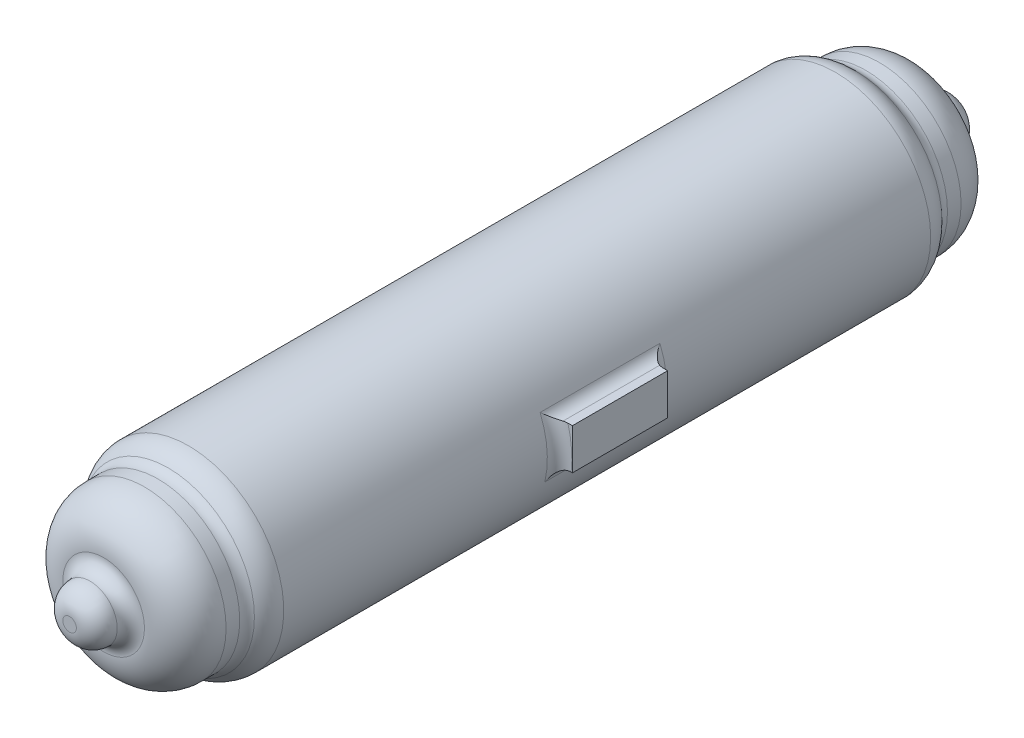
ISO-10303-21;
HEADER;
FILE_DESCRIPTION(('STEP AP214'),'2;1');
FILE_NAME('part.step','',(''),(''),'','','');
FILE_SCHEMA(('AUTOMOTIVE_DESIGN { 1 0 10303 214 1 1 1 1 }'));
ENDSEC;
DATA;
#1=APPLICATION_CONTEXT('core data for automotive mechanical design processes');
#2=APPLICATION_PROTOCOL_DEFINITION('international standard','automotive_design',2000,#1);
#3=PRODUCT_CONTEXT('',#1,'mechanical');
#4=PRODUCT('Part','Part','',(#3));
#5=PRODUCT_RELATED_PRODUCT_CATEGORY('part','',(#4));
#6=PRODUCT_DEFINITION_FORMATION('','',#4);
#7=PRODUCT_DEFINITION_CONTEXT('part definition',#1,'design');
#8=PRODUCT_DEFINITION('design','',#6,#7);
#9=PRODUCT_DEFINITION_SHAPE('','',#8);
#10=(LENGTH_UNIT() NAMED_UNIT(*) SI_UNIT(.MILLI.,.METRE.));
#11=(NAMED_UNIT(*) PLANE_ANGLE_UNIT() SI_UNIT($,.RADIAN.));
#12=(NAMED_UNIT(*) SI_UNIT($,.STERADIAN.) SOLID_ANGLE_UNIT());
#13=UNCERTAINTY_MEASURE_WITH_UNIT(LENGTH_MEASURE(1.E-05),#10,'distance_accuracy_value','');
#14=(GEOMETRIC_REPRESENTATION_CONTEXT(3) GLOBAL_UNCERTAINTY_ASSIGNED_CONTEXT((#13)) GLOBAL_UNIT_ASSIGNED_CONTEXT((#10,
#11,#12)) REPRESENTATION_CONTEXT('',''));
#15=CARTESIAN_POINT('',(0.,0.,0.));
#16=DIRECTION('',(0.,0.,1.));
#17=DIRECTION('',(1.,0.,0.));
#18=AXIS2_PLACEMENT_3D('',#15,#16,#17);
#19=CARTESIAN_POINT('',(0.,0.,-237.639320225002));
#20=DIRECTION('',(0.,0.,1.));
#21=DIRECTION('',(1.,0.,0.));
#22=AXIS2_PLACEMENT_3D('',#19,#20,#21);
#23=TOROIDAL_SURFACE('',#22,50.,20.);
#24=CARTESIAN_POINT('',(0.,0.,-252.546440075001));
#25=DIRECTION('',(0.,0.,-1.));
#26=DIRECTION('',(-1.,0.,0.));
#27=AXIS2_PLACEMENT_3D('',#24,#25,#26);
#28=CIRCLE('',#27,63.3333333333334);
#29=CARTESIAN_POINT('',(-63.3333333333334,0.,-252.546440075001));
#30=VERTEX_POINT('',#29);
#31=EDGE_CURVE('E49',#30,#30,#28,.T.);
#32=ORIENTED_EDGE('',*,*,#31,.F.);
#33=EDGE_LOOP('',(#32));
#34=FACE_BOUND('',#33,.T.);
#35=CARTESIAN_POINT('',(0.,0.,-237.639320225002));
#36=DIRECTION('',(0.,0.,1.));
#37=DIRECTION('',(1.,0.,0.));
#38=AXIS2_PLACEMENT_3D('',#35,#36,#37);
#39=CIRCLE('',#38,70.);
#40=CARTESIAN_POINT('',(70.,0.,-237.639320225002));
#41=VERTEX_POINT('',#40);
#42=EDGE_CURVE('E12',#41,#41,#39,.T.);
#43=ORIENTED_EDGE('',*,*,#42,.F.);
#44=EDGE_LOOP('',(#43));
#45=FACE_BOUND('',#44,.T.);
#46=ADVANCED_FACE('F41',(#34,#45),#23,.T.);
#47=CARTESIAN_POINT('',(0.,0.,-260.));
#48=DIRECTION('',(0.,0.,1.));
#49=DIRECTION('',(1.,0.,0.));
#50=AXIS2_PLACEMENT_3D('',#47,#48,#49);
#51=TOROIDAL_SURFACE('',#50,70.,10.);
#52=ORIENTED_EDGE('',*,*,#31,.T.);
#53=EDGE_LOOP('',(#52));
#54=FACE_BOUND('',#53,.T.);
#55=CARTESIAN_POINT('',(0.,0.,-260.));
#56=DIRECTION('',(0.,0.,1.));
#57=DIRECTION('',(1.,0.,0.));
#58=AXIS2_PLACEMENT_3D('',#55,#56,#57);
#59=CIRCLE('',#58,60.);
#60=CARTESIAN_POINT('',(60.,0.,-260.));
#61=VERTEX_POINT('',#60);
#62=EDGE_CURVE('E303',#61,#61,#59,.F.);
#63=ORIENTED_EDGE('',*,*,#62,.F.);
#64=EDGE_LOOP('',(#63));
#65=FACE_BOUND('',#64,.T.);
#66=ADVANCED_FACE('F290',(#54,#65),#51,.F.);
#67=CARTESIAN_POINT('',(0.,0.,237.639320225002));
#68=DIRECTION('',(0.,0.,-1.));
#69=DIRECTION('',(-1.,0.,0.));
#70=AXIS2_PLACEMENT_3D('',#67,#68,#69);
#71=TOROIDAL_SURFACE('',#70,50.,20.);
#72=CARTESIAN_POINT('',(0.,0.,252.546440075001));
#73=DIRECTION('',(0.,0.,1.));
#74=DIRECTION('',(1.,0.,0.));
#75=AXIS2_PLACEMENT_3D('',#72,#73,#74);
#76=CIRCLE('',#75,63.3333333333333);
#77=CARTESIAN_POINT('',(63.3333333333333,0.,252.546440075001));
#78=VERTEX_POINT('',#77);
#79=EDGE_CURVE('E311',#78,#78,#76,.T.);
#80=ORIENTED_EDGE('',*,*,#79,.F.);
#81=EDGE_LOOP('',(#80));
#82=FACE_BOUND('',#81,.T.);
#83=CARTESIAN_POINT('',(0.,0.,237.639320225002));
#84=DIRECTION('',(0.,0.,-1.));
#85=DIRECTION('',(-1.,0.,0.));
#86=AXIS2_PLACEMENT_3D('',#83,#84,#85);
#87=CIRCLE('',#86,70.);
#88=CARTESIAN_POINT('',(-70.,0.,237.639320225002));
#89=VERTEX_POINT('',#88);
#90=EDGE_CURVE('E306',#89,#89,#87,.T.);
#91=ORIENTED_EDGE('',*,*,#90,.F.);
#92=EDGE_LOOP('',(#91));
#93=FACE_BOUND('',#92,.T.);
#94=ADVANCED_FACE('F287',(#82,#93),#71,.T.);
#95=CARTESIAN_POINT('',(0.,0.,260.));
#96=DIRECTION('',(0.,0.,1.));
#97=DIRECTION('',(1.,0.,0.));
#98=AXIS2_PLACEMENT_3D('',#95,#96,#97);
#99=TOROIDAL_SURFACE('',#98,70.,10.);
#100=ORIENTED_EDGE('',*,*,#79,.T.);
#101=EDGE_LOOP('',(#100));
#102=FACE_BOUND('',#101,.T.);
#103=CARTESIAN_POINT('',(0.,0.,260.));
#104=DIRECTION('',(0.,0.,1.));
#105=DIRECTION('',(1.,0.,0.));
#106=AXIS2_PLACEMENT_3D('',#103,#104,#105);
#107=CIRCLE('',#106,60.);
#108=CARTESIAN_POINT('',(60.,0.,260.));
#109=VERTEX_POINT('',#108);
#110=EDGE_CURVE('E316',#109,#109,#107,.T.);
#111=ORIENTED_EDGE('',*,*,#110,.F.);
#112=EDGE_LOOP('',(#111));
#113=FACE_BOUND('',#112,.T.);
#114=ADVANCED_FACE('F283',(#102,#113),#99,.F.);
#115=CARTESIAN_POINT('',(76.9446358125888,-17.9031566956245,250.));
#116=DIRECTION('',(0.,0.,-1.));
#117=DIRECTION('',(-1.,0.,0.));
#118=AXIS2_PLACEMENT_3D('',#115,#116,#117);
#119=CYLINDRICAL_SURFACE('',#118,9.);
#120=CARTESIAN_POINT('',(76.9446358125888,-8.90315669562447,-35.1330803444123));
#121=CARTESIAN_POINT('',(76.8339645059694,-8.90315493318954,-35.1521969879144));
#122=CARTESIAN_POINT('',(76.7236628981182,-8.90519853367659,-35.173319306642));
#123=CARTESIAN_POINT('',(76.5040417115562,-8.91327649145585,-35.2194566820043));
#124=CARTESIAN_POINT('',(76.3947219781456,-8.91931020849282,-35.2444711136172));
#125=CARTESIAN_POINT('',(76.0689197763461,-8.94322022670623,-35.3250924864422));
#126=CARTESIAN_POINT('',(75.8542126586325,-8.96690609617652,-35.3863439769867));
#127=CARTESIAN_POINT('',(75.4336486588862,-9.02838069555526,-35.5219440902154));
#128=CARTESIAN_POINT('',(75.2277228471797,-9.0660198273779,-35.5961495169001));
#129=CARTESIAN_POINT('',(74.8235070156009,-9.15423557916891,-35.7568080644692));
#130=CARTESIAN_POINT('',(74.6252196860896,-9.20481671037972,-35.8432654513686));
#131=CARTESIAN_POINT('',(74.2383919874291,-9.31732058180232,-36.0265278970516));
#132=CARTESIAN_POINT('',(74.0498006174826,-9.37917400629715,-36.1232682859496));
#133=CARTESIAN_POINT('',(73.6816918791693,-9.51318785961963,-36.3262162546603));
#134=CARTESIAN_POINT('',(73.5021735601506,-9.5853472055746,-36.4324228393926));
#135=CARTESIAN_POINT('',(72.976628016284,-9.81603591903803,-36.7641397146616));
#136=CARTESIAN_POINT('',(72.644523158482,-9.98850076933427,-37.0023051751521));
#137=CARTESIAN_POINT('',(72.0800830274243,-10.3254275164063,-37.4542742445337));
#138=CARTESIAN_POINT('',(71.8409773735565,-10.4847813607783,-37.663644087628));
#139=CARTESIAN_POINT('',(71.3863405542848,-10.8190238571233,-38.0954445196285));
#140=CARTESIAN_POINT('',(71.1708210890001,-10.9939201418015,-38.3178815072746));
#141=CARTESIAN_POINT('',(70.762265490633,-11.3569244871966,-38.7734393434941));
#142=CARTESIAN_POINT('',(70.5692783330239,-11.5450599531372,-39.0065819845213));
#143=CARTESIAN_POINT('',(70.2054015140808,-11.9321219805371,-39.4808775498524));
#144=CARTESIAN_POINT('',(70.03451010299,-12.1310476857468,-39.7220298379711));
#145=CARTESIAN_POINT('',(69.6629904027146,-12.6027578199943,-40.2882007136749));
#146=CARTESIAN_POINT('',(69.4701613915597,-12.8789302377661,-40.6155250444978));
#147=CARTESIAN_POINT('',(69.1196612857071,-13.4444056727558,-41.2777136918351));
#148=CARTESIAN_POINT('',(68.9620057791744,-13.7337144436454,-41.6125812792707));
#149=CARTESIAN_POINT('',(68.6811368507772,-14.3225477728143,-42.2862180462611));
#150=CARTESIAN_POINT('',(68.5578479434008,-14.6220482940046,-42.6249769456749));
#151=CARTESIAN_POINT('',(68.3447335235228,-15.2300768604686,-43.3045913923678));
#152=CARTESIAN_POINT('',(68.254886264927,-15.5385988980286,-43.6454454301209));
#153=CARTESIAN_POINT('',(68.1807590755132,-15.8551129291248,-43.9907895818551));
#154=CARTESIAN_POINT('',(68.1797736248304,-15.8593344040268,-43.9953948030136));
#155=CARTESIAN_POINT('',(68.1787912263445,-15.8635565657432,-44.));
#156=B_SPLINE_CURVE_WITH_KNOTS('',3,(#120,#121,#122,#123,#124,#125,#126,#127,#128,#129,#130,
#131,#132,#133,#134,#135,#136,#137,#138,#139,#140,#141,#142,#143,#144,#145,#146,#147,#148,#149,
#150,#151,#152,#153,#154,#155),.UNSPECIFIED.,.F.,.F.,(4,2,2,2,2,2,2,2,2,2,2,2,2,2,2,2,2,4),(0.,
0.336851049774516,0.673648061442833,1.34608514120215,2.01151199204817,2.67717111003305,
3.3388671906817,4.00049379610853,5.32687064617143,6.39214059788593,7.45793661272515,
8.52600770006759,9.59399415525058,11.0012535181678,12.4091353157129,13.8138999156169,
15.2177494369689,15.2367231052564),.UNSPECIFIED.);
#157=CARTESIAN_POINT('',(76.9446358125888,-8.90315669562447,-35.1330803444123));
#158=VERTEX_POINT('',#157);
#159=CARTESIAN_POINT('',(68.1787912263445,-15.8635565657432,-44.));
#160=VERTEX_POINT('',#159);
#161=EDGE_CURVE('E274',#158,#160,#156,.T.);
#162=ORIENTED_EDGE('',*,*,#161,.F.);
#163=DIRECTION('',(0.,0.,1.));
#164=VECTOR('',#163,1.);
#165=CARTESIAN_POINT('',(76.9446358125888,-8.90315669562447,250.));
#166=LINE('',#165,#164);
#167=CARTESIAN_POINT('',(76.9446358125888,-8.90315669562447,35.1330803444123));
#168=VERTEX_POINT('',#167);
#169=EDGE_CURVE('E56',#168,#158,#166,.F.);
#170=ORIENTED_EDGE('',*,*,#169,.F.);
#171=CARTESIAN_POINT('',(76.9446358125888,-8.90315669562447,35.1330803444123));
#172=CARTESIAN_POINT('',(76.8339645059694,-8.90315493318954,35.1521969879145));
#173=CARTESIAN_POINT('',(76.7236628981182,-8.90519853367659,35.173319306642));
#174=CARTESIAN_POINT('',(76.5040417115562,-8.91327649145585,35.2194566820044));
#175=CARTESIAN_POINT('',(76.3947219781456,-8.91931020849282,35.2444711136172));
#176=CARTESIAN_POINT('',(76.0689197763461,-8.94322022670623,35.3250924864422));
#177=CARTESIAN_POINT('',(75.8542126586325,-8.96690609617652,35.3863439769867));
#178=CARTESIAN_POINT('',(75.4336486588862,-9.02838069555526,35.5219440902155));
#179=CARTESIAN_POINT('',(75.2277228471797,-9.0660198273779,35.5961495169002));
#180=CARTESIAN_POINT('',(74.8235070156009,-9.15423557916891,35.7568080644693));
#181=CARTESIAN_POINT('',(74.6252196860896,-9.20481671037972,35.8432654513686));
#182=CARTESIAN_POINT('',(74.2383919874291,-9.31732058180232,36.0265278970516));
#183=CARTESIAN_POINT('',(74.0498006174826,-9.37917400629715,36.1232682859496));
#184=CARTESIAN_POINT('',(73.6816918791693,-9.51318785961963,36.3262162546603));
#185=CARTESIAN_POINT('',(73.5021735601506,-9.5853472055746,36.4324228393926));
#186=CARTESIAN_POINT('',(72.976628016284,-9.81603591903803,36.7641397146616));
#187=CARTESIAN_POINT('',(72.644523158482,-9.98850076933427,37.0023051751522));
#188=CARTESIAN_POINT('',(72.0800830274243,-10.3254275164063,37.4542742445337));
#189=CARTESIAN_POINT('',(71.8409773735565,-10.4847813607783,37.663644087628));
#190=CARTESIAN_POINT('',(71.3863405542848,-10.8190238571233,38.0954445196285));
#191=CARTESIAN_POINT('',(71.1708210890001,-10.9939201418015,38.3178815072746));
#192=CARTESIAN_POINT('',(70.762265490633,-11.3569244871966,38.7734393434941));
#193=CARTESIAN_POINT('',(70.5692783330239,-11.5450599531372,39.0065819845213));
#194=CARTESIAN_POINT('',(70.2054015140808,-11.9321219805371,39.4808775498524));
#195=CARTESIAN_POINT('',(70.03451010299,-12.1310476857468,39.7220298379711));
#196=CARTESIAN_POINT('',(69.6629904027146,-12.6027578199943,40.288200713675));
#197=CARTESIAN_POINT('',(69.4701613915597,-12.8789302377661,40.6155250444978));
#198=CARTESIAN_POINT('',(69.1196612857071,-13.4444056727558,41.2777136918351));
#199=CARTESIAN_POINT('',(68.9620057791744,-13.7337144436454,41.6125812792707));
#200=CARTESIAN_POINT('',(68.6811368507772,-14.3225477728143,42.2862180462611));
#201=CARTESIAN_POINT('',(68.5578479434008,-14.6220482940046,42.6249769456749));
#202=CARTESIAN_POINT('',(68.3447335235228,-15.2300768604686,43.3045913923679));
#203=CARTESIAN_POINT('',(68.254886264927,-15.5385988980286,43.6454454301209));
#204=CARTESIAN_POINT('',(68.1807590755132,-15.8551129291248,43.9907895818551));
#205=CARTESIAN_POINT('',(68.1797736248304,-15.8593344040268,43.9953948030136));
#206=CARTESIAN_POINT('',(68.1787912263445,-15.8635565657432,44.));
#207=B_SPLINE_CURVE_WITH_KNOTS('',3,(#171,#172,#173,#174,#175,#176,#177,#178,#179,#180,#181,
#182,#183,#184,#185,#186,#187,#188,#189,#190,#191,#192,#193,#194,#195,#196,#197,#198,#199,#200,
#201,#202,#203,#204,#205,#206),.UNSPECIFIED.,.F.,.F.,(4,2,2,2,2,2,2,2,2,2,2,2,2,2,2,2,2,4),(0.,
0.336851049774516,0.673648061442833,1.34608514120215,2.01151199204817,2.67717111003305,
3.3388671906817,4.00049379610853,5.32687064617143,6.39214059788593,7.45793661272515,
8.52600770006759,9.59399415525058,11.0012535181678,12.4091353157129,13.8138999156169,
15.2177494369689,15.2367231052564),.UNSPECIFIED.);
#208=CARTESIAN_POINT('',(68.1787912263445,-15.8635565657432,44.));
#209=VERTEX_POINT('',#208);
#210=EDGE_CURVE('E267',#168,#209,#207,.T.);
#211=ORIENTED_EDGE('',*,*,#210,.T.);
#212=DIRECTION('',(0.,0.,-1.));
#213=VECTOR('',#212,1.);
#214=CARTESIAN_POINT('',(68.1787912263445,-15.8635565657432,250.));
#215=LINE('',#214,#213);
#216=EDGE_CURVE('E176',#160,#209,#215,.F.);
#217=ORIENTED_EDGE('',*,*,#216,.F.);
#218=EDGE_LOOP('',(#162,#170,#211,#217));
#219=FACE_BOUND('',#218,.T.);
#220=ADVANCED_FACE('F253',(#219),#119,.F.);
#221=CARTESIAN_POINT('',(0.,0.,44.));
#222=DIRECTION('',(0.,0.,-1.));
#223=DIRECTION('',(-1.,0.,0.));
#224=AXIS2_PLACEMENT_3D('',#221,#222,#223);
#225=TOROIDAL_SURFACE('',#224,79.,9.);
#226=ORIENTED_EDGE('',*,*,#210,.F.);
#227=CARTESIAN_POINT('',(76.9446358125888,-8.90315669562447,35.1330803444123));
#228=CARTESIAN_POINT('',(77.2014169186937,-8.90315669562447,35.0887621161174));
#229=CARTESIAN_POINT('',(77.4591471263024,-8.90315669562447,35.0555129732738));
#230=CARTESIAN_POINT('',(77.9765058673671,-8.90315669562447,35.0111528479569));
#231=CARTESIAN_POINT('',(78.2361344017245,-8.90315669562447,35.0000418759964));
#232=CARTESIAN_POINT('',(78.4967120384871,-8.90315669562447,35.));
#233=B_SPLINE_CURVE_WITH_KNOTS('',3,(#227,#228,#229,#230,#231,#232),.UNSPECIFIED.,.F.,.F.,(4,2,
4),(0.,0.779598158492503,1.55919668719435),.UNSPECIFIED.);
#234=CARTESIAN_POINT('',(78.4967120384871,-8.90315669562447,35.));
#235=VERTEX_POINT('',#234);
#236=EDGE_CURVE('E230',#235,#168,#233,.F.);
#237=ORIENTED_EDGE('',*,*,#236,.F.);
#238=CARTESIAN_POINT('',(0.,0.,35.));
#239=DIRECTION('',(0.,0.,-1.));
#240=DIRECTION('',(-1.,0.,0.));
#241=AXIS2_PLACEMENT_3D('',#238,#239,#240);
#242=CIRCLE('',#241,79.);
#243=CARTESIAN_POINT('',(76.1309608673806,21.0968433043755,35.));
#244=VERTEX_POINT('',#243);
#245=EDGE_CURVE('E194',#244,#235,#242,.T.);
#246=ORIENTED_EDGE('',*,*,#245,.F.);
#247=CARTESIAN_POINT('',(76.1309608673806,21.0968433043755,35.));
#248=CARTESIAN_POINT('',(75.8681508332055,21.0968433043755,34.9999822774768));
#249=CARTESIAN_POINT('',(75.6053460157413,21.0968433043755,35.0106905520901));
#250=CARTESIAN_POINT('',(75.0831770517015,21.0968433043755,35.0532375005064));
#251=CARTESIAN_POINT('',(74.8238016439224,21.0968433043755,35.0849379978813));
#252=CARTESIAN_POINT('',(74.3084557039351,21.0968433043755,35.1691524802424));
#253=CARTESIAN_POINT('',(74.0524851133079,21.0968433043755,35.221666107646));
#254=CARTESIAN_POINT('',(73.5439526244104,21.0968433043755,35.3475852830205));
#255=CARTESIAN_POINT('',(73.2914241047833,21.0968433043755,35.4211256289625));
#256=CARTESIAN_POINT('',(73.042316660357,21.0968433043755,35.5048709587407));
#257=B_SPLINE_CURVE_WITH_KNOTS('',3,(#247,#248,#249,#250,#251,#252,#253,#254,#255,#256),
.UNSPECIFIED.,.F.,.F.,(4,2,2,2,4),(0.,0.788204161147778,1.5712710464994,2.35432447885427,
3.14251500617013),.UNSPECIFIED.);
#258=CARTESIAN_POINT('',(73.042316660357,21.0968433043755,35.5048709587407));
#259=VERTEX_POINT('',#258);
#260=EDGE_CURVE('E113',#259,#244,#257,.F.);
#261=ORIENTED_EDGE('',*,*,#260,.F.);
#262=CARTESIAN_POINT('',(73.042316660357,21.0968433043755,35.5048709587407));
#263=CARTESIAN_POINT('',(72.7953696557035,21.0968167949234,35.5878337247568));
#264=CARTESIAN_POINT('',(72.5517264266638,21.1070028410716,35.6798939460691));
#265=CARTESIAN_POINT('',(72.0731347793559,21.1459740200223,35.8798630214084));
#266=CARTESIAN_POINT('',(71.8381691317983,21.1747199412943,35.9877380928008));
#267=CARTESIAN_POINT('',(71.3807427778729,21.2485517306069,36.21597283515));
#268=CARTESIAN_POINT('',(71.1581654011846,21.2934362708248,36.3361661749019));
#269=CARTESIAN_POINT('',(70.7231909903968,21.3978944087016,36.5882610903496));
#270=CARTESIAN_POINT('',(70.5108007202251,21.4574776088725,36.7201702837182));
#271=CARTESIAN_POINT('',(70.0382736028182,21.6084138634419,37.032636883215));
#272=CARTESIAN_POINT('',(69.7816077327723,21.7039865447555,37.2164068942199));
#273=CARTESIAN_POINT('',(69.2863703701836,21.913616402145,37.5971747379357));
#274=CARTESIAN_POINT('',(69.0478014894382,22.0276762389053,37.7941744722839));
#275=CARTESIAN_POINT('',(68.5872100332019,22.2724930132453,38.2000814619278));
#276=CARTESIAN_POINT('',(68.3652978290427,22.403348000596,38.4090542968654));
#277=CARTESIAN_POINT('',(67.9392866079286,22.6790632208266,38.8356469082324));
#278=CARTESIAN_POINT('',(67.7351884224006,22.8239241067341,39.053267087567));
#279=CARTESIAN_POINT('',(67.2626469555809,23.1890153818194,39.5877950952529));
#280=CARTESIAN_POINT('',(67.0029359783354,23.4154534426394,39.9082068012195));
#281=CARTESIAN_POINT('',(66.5169744452642,23.889178175672,40.5589626329876));
#282=CARTESIAN_POINT('',(66.2907411021914,24.1364754709217,40.8893117638777));
#283=CARTESIAN_POINT('',(65.8713038082273,24.6483754129503,41.5558537302301));
#284=CARTESIAN_POINT('',(65.6780235239321,24.9129360474215,41.892031017031));
#285=CARTESIAN_POINT('',(65.3232986762071,25.4576285680185,42.5681913052122));
#286=CARTESIAN_POINT('',(65.1618353287435,25.7377511407191,42.9081719351232));
#287=CARTESIAN_POINT('',(64.9637061878084,26.1282801416689,43.3716532289937));
#288=CARTESIAN_POINT('',(64.9132763950607,26.2326334837424,43.494522348968));
#289=CARTESIAN_POINT('',(64.8165449671819,26.4430663064843,43.7403242675083));
#290=CARTESIAN_POINT('',(64.7702415419494,26.5491450148033,43.8632570149613));
#291=CARTESIAN_POINT('',(64.7243459806889,26.6600741015024,43.9907895685099));
#292=CARTESIAN_POINT('',(64.7226915801851,26.6640809609933,43.995394789743));
#293=CARTESIAN_POINT('',(64.7210400787974,26.6680890038771,44.));
#294=B_SPLINE_CURVE_WITH_KNOTS('',3,(#262,#263,#264,#265,#266,#267,#268,#269,#270,#271,#272,
#273,#274,#275,#276,#277,#278,#279,#280,#281,#282,#283,#284,#285,#286,#287,#288,#289,#290,#291,
#292,#293),.UNSPECIFIED.,.F.,.F.,(4,2,2,2,2,2,2,2,2,2,2,2,2,2,2,4),(0.,0.780813084778847,
1.55998191640193,2.32974998517012,3.10002227496107,4.08799574436563,5.07611153006743,
6.07028333900643,7.06450152376198,8.47400060434402,9.88422188905141,11.2911307548812,
12.6972065069883,13.2038913245743,13.7103552510196,13.7293289193071),.UNSPECIFIED.);
#295=CARTESIAN_POINT('',(64.7210400787974,26.668089003877,44.));
#296=VERTEX_POINT('',#295);
#297=EDGE_CURVE('E261',#259,#296,#294,.T.);
#298=ORIENTED_EDGE('',*,*,#297,.T.);
#299=CARTESIAN_POINT('',(0.,0.,44.));
#300=DIRECTION('',(0.,0.,-1.));
#301=DIRECTION('',(-1.,0.,0.));
#302=AXIS2_PLACEMENT_3D('',#299,#300,#301);
#303=CIRCLE('',#302,70.);
#304=EDGE_CURVE('E180',#209,#296,#303,.F.);
#305=ORIENTED_EDGE('',*,*,#304,.F.);
#306=EDGE_LOOP('',(#226,#237,#246,#261,#298,#305));
#307=FACE_BOUND('',#306,.T.);
#308=ADVANCED_FACE('F249',(#307),#225,.F.);
#309=CARTESIAN_POINT('',(73.042316660357,30.0968433043755,250.));
#310=DIRECTION('',(0.,0.,-1.));
#311=DIRECTION('',(-1.,0.,0.));
#312=AXIS2_PLACEMENT_3D('',#309,#310,#311);
#313=CYLINDRICAL_SURFACE('',#312,9.);
#314=ORIENTED_EDGE('',*,*,#297,.F.);
#315=DIRECTION('',(0.,0.,1.));
#316=VECTOR('',#315,1.);
#317=CARTESIAN_POINT('',(73.042316660357,21.0968433043755,250.));
#318=LINE('',#317,#316);
#319=CARTESIAN_POINT('',(73.042316660357,21.0968433043755,-35.5048709587407));
#320=VERTEX_POINT('',#319);
#321=EDGE_CURVE('E64',#320,#259,#318,.T.);
#322=ORIENTED_EDGE('',*,*,#321,.F.);
#323=CARTESIAN_POINT('',(73.042316660357,21.0968433043755,-35.5048709587407));
#324=CARTESIAN_POINT('',(72.7953696557035,21.0968167949234,-35.5878337247568));
#325=CARTESIAN_POINT('',(72.5517264266638,21.1070028410716,-35.6798939460691));
#326=CARTESIAN_POINT('',(72.0731347793559,21.1459740200223,-35.8798630214084));
#327=CARTESIAN_POINT('',(71.8381691317983,21.1747199412943,-35.9877380928007));
#328=CARTESIAN_POINT('',(71.3807427778729,21.2485517306069,-36.21597283515));
#329=CARTESIAN_POINT('',(71.1581654011846,21.2934362708248,-36.3361661749019));
#330=CARTESIAN_POINT('',(70.7231909903968,21.3978944087016,-36.5882610903495));
#331=CARTESIAN_POINT('',(70.5108007202251,21.4574776088725,-36.7201702837181));
#332=CARTESIAN_POINT('',(70.0382736028182,21.6084138634419,-37.032636883215));
#333=CARTESIAN_POINT('',(69.7816077327723,21.7039865447555,-37.2164068942199));
#334=CARTESIAN_POINT('',(69.2863703701836,21.913616402145,-37.5971747379357));
#335=CARTESIAN_POINT('',(69.0478014894382,22.0276762389053,-37.7941744722839));
#336=CARTESIAN_POINT('',(68.5872100332019,22.2724930132453,-38.2000814619278));
#337=CARTESIAN_POINT('',(68.3652978290427,22.403348000596,-38.4090542968653));
#338=CARTESIAN_POINT('',(67.9392866079286,22.6790632208266,-38.8356469082324));
#339=CARTESIAN_POINT('',(67.7351884224006,22.8239241067341,-39.053267087567));
#340=CARTESIAN_POINT('',(67.2626469555809,23.1890153818194,-39.5877950952529));
#341=CARTESIAN_POINT('',(67.0029359783354,23.4154534426394,-39.9082068012195));
#342=CARTESIAN_POINT('',(66.5169744452643,23.889178175672,-40.5589626329876));
#343=CARTESIAN_POINT('',(66.2907411021914,24.1364754709217,-40.8893117638777));
#344=CARTESIAN_POINT('',(65.8713038082273,24.6483754129503,-41.5558537302301));
#345=CARTESIAN_POINT('',(65.6780235239321,24.9129360474215,-41.8920310170309));
#346=CARTESIAN_POINT('',(65.3232986762071,25.4576285680185,-42.5681913052122));
#347=CARTESIAN_POINT('',(65.1618353287435,25.737751140719,-42.9081719351232));
#348=CARTESIAN_POINT('',(64.9637061878084,26.1282801416689,-43.3716532289937));
#349=CARTESIAN_POINT('',(64.9132763950607,26.2326334837425,-43.494522348968));
#350=CARTESIAN_POINT('',(64.8165449671819,26.4430663064844,-43.7403242675082));
#351=CARTESIAN_POINT('',(64.7702415419494,26.5491450148032,-43.8632570149613));
#352=CARTESIAN_POINT('',(64.7243459806889,26.6600741015024,-43.9907895685098));
#353=CARTESIAN_POINT('',(64.7226915801851,26.6640809609933,-43.9953947897429));
#354=CARTESIAN_POINT('',(64.7210400787974,26.6680890038771,-44.));
#355=B_SPLINE_CURVE_WITH_KNOTS('',3,(#323,#324,#325,#326,#327,#328,#329,#330,#331,#332,#333,
#334,#335,#336,#337,#338,#339,#340,#341,#342,#343,#344,#345,#346,#347,#348,#349,#350,#351,#352,
#353,#354),.UNSPECIFIED.,.F.,.F.,(4,2,2,2,2,2,2,2,2,2,2,2,2,2,2,4),(0.,0.780813084778847,
1.55998191640193,2.32974998517012,3.10002227496107,4.08799574436563,5.07611153006744,
6.07028333900645,7.06450152376198,8.474000604344,9.8842218890514,11.2911307548812,
12.6972065069883,13.2038913245744,13.7103552510196,13.7293289193071),.UNSPECIFIED.);
#356=CARTESIAN_POINT('',(64.7210400787974,26.668089003877,-44.));
#357=VERTEX_POINT('',#356);
#358=EDGE_CURVE('E238',#320,#357,#355,.T.);
#359=ORIENTED_EDGE('',*,*,#358,.T.);
#360=DIRECTION('',(0.,0.,-1.));
#361=VECTOR('',#360,1.);
#362=CARTESIAN_POINT('',(64.7210400787974,26.668089003877,250.));
#363=LINE('',#362,#361);
#364=EDGE_CURVE('E184',#296,#357,#363,.T.);
#365=ORIENTED_EDGE('',*,*,#364,.F.);
#366=EDGE_LOOP('',(#314,#322,#359,#365));
#367=FACE_BOUND('',#366,.T.);
#368=ADVANCED_FACE('F252',(#367),#313,.F.);
#369=CARTESIAN_POINT('',(0.,0.,-44.));
#370=DIRECTION('',(0.,0.,-1.));
#371=DIRECTION('',(-1.,0.,0.));
#372=AXIS2_PLACEMENT_3D('',#369,#370,#371);
#373=TOROIDAL_SURFACE('',#372,79.,9.);
#374=CARTESIAN_POINT('',(78.4967120384871,-8.90315669562447,-35.));
#375=CARTESIAN_POINT('',(78.2361344017245,-8.90315669562447,-35.0000418759963));
#376=CARTESIAN_POINT('',(77.9765058673671,-8.90315669562447,-35.0111528479569));
#377=CARTESIAN_POINT('',(77.4591471263024,-8.90315669562447,-35.0555129732738));
#378=CARTESIAN_POINT('',(77.2014169186937,-8.90315669562447,-35.0887621161173));
#379=CARTESIAN_POINT('',(76.9446358125888,-8.90315669562447,-35.1330803444123));
#380=B_SPLINE_CURVE_WITH_KNOTS('',3,(#374,#375,#376,#377,#378,#379),.UNSPECIFIED.,.F.,.F.,(4,2,
4),(0.,0.779598528701857,1.55919668719436),.UNSPECIFIED.);
#381=CARTESIAN_POINT('',(78.4967120384871,-8.90315669562447,-35.));
#382=VERTEX_POINT('',#381);
#383=EDGE_CURVE('E199',#158,#382,#380,.F.);
#384=ORIENTED_EDGE('',*,*,#383,.F.);
#385=ORIENTED_EDGE('',*,*,#161,.T.);
#386=CARTESIAN_POINT('',(0.,0.,-44.));
#387=DIRECTION('',(0.,0.,-1.));
#388=DIRECTION('',(-1.,0.,0.));
#389=AXIS2_PLACEMENT_3D('',#386,#387,#388);
#390=CIRCLE('',#389,70.);
#391=EDGE_CURVE('E188',#357,#160,#390,.T.);
#392=ORIENTED_EDGE('',*,*,#391,.F.);
#393=ORIENTED_EDGE('',*,*,#358,.F.);
#394=CARTESIAN_POINT('',(73.042316660357,21.0968433043755,-35.5048709587407));
#395=CARTESIAN_POINT('',(73.2914241047833,21.0968433043755,-35.4211256289625));
#396=CARTESIAN_POINT('',(73.5439526244104,21.0968433043755,-35.3475852830205));
#397=CARTESIAN_POINT('',(74.0524851133079,21.0968433043755,-35.221666107646));
#398=CARTESIAN_POINT('',(74.3084557039351,21.0968433043755,-35.1691524802423));
#399=CARTESIAN_POINT('',(74.8238016439224,21.0968433043755,-35.0849379978812));
#400=CARTESIAN_POINT('',(75.0831770517015,21.0968433043755,-35.0532375005064));
#401=CARTESIAN_POINT('',(75.6053460157413,21.0968433043755,-35.0106905520901));
#402=CARTESIAN_POINT('',(75.8681508332055,21.0968433043755,-34.9999822774768));
#403=CARTESIAN_POINT('',(76.1309608673805,21.0968433043755,-35.));
#404=B_SPLINE_CURVE_WITH_KNOTS('',3,(#394,#395,#396,#397,#398,#399,#400,#401,#402,#403),
.UNSPECIFIED.,.F.,.F.,(4,2,2,2,4),(0.,0.78819052731586,1.57124395967073,2.35431084502235,
3.14251500617012),.UNSPECIFIED.);
#405=CARTESIAN_POINT('',(76.1309608673806,21.0968433043755,-35.));
#406=VERTEX_POINT('',#405);
#407=EDGE_CURVE('E208',#406,#320,#404,.F.);
#408=ORIENTED_EDGE('',*,*,#407,.F.);
#409=CARTESIAN_POINT('',(0.,0.,-35.));
#410=DIRECTION('',(0.,0.,-1.));
#411=DIRECTION('',(-1.,0.,0.));
#412=AXIS2_PLACEMENT_3D('',#409,#410,#411);
#413=CIRCLE('',#412,79.);
#414=EDGE_CURVE('E172',#382,#406,#413,.F.);
#415=ORIENTED_EDGE('',*,*,#414,.F.);
#416=EDGE_LOOP('',(#384,#385,#392,#393,#408,#415));
#417=FACE_BOUND('',#416,.T.);
#418=ADVANCED_FACE('F215',(#417),#373,.F.);
#419=CARTESIAN_POINT('',(0.,0.,270.));
#420=DIRECTION('',(0.,0.,1.));
#421=DIRECTION('',(1.,0.,0.));
#422=AXIS2_PLACEMENT_3D('',#419,#420,#421);
#423=DEGENERATE_TOROIDAL_SURFACE('',#422,30.,30.,.T.);
#424=CARTESIAN_POINT('',(0.,0.,300.));
#425=DIRECTION('',(0.,0.,1.));
#426=DIRECTION('',(1.,0.,0.));
#427=AXIS2_PLACEMENT_3D('',#424,#425,#426);
#428=CIRCLE('',#427,30.);
#429=CARTESIAN_POINT('',(30.,0.,300.));
#430=VERTEX_POINT('',#429);
#431=EDGE_CURVE('E164',#430,#430,#428,.F.);
#432=ORIENTED_EDGE('',*,*,#431,.T.);
#433=EDGE_LOOP('',(#432));
#434=FACE_BOUND('',#433,.T.);
#435=CARTESIAN_POINT('',(0.,0.,270.));
#436=DIRECTION('',(0.,0.,1.));
#437=DIRECTION('',(1.,0.,0.));
#438=AXIS2_PLACEMENT_3D('',#435,#436,#437);
#439=CIRCLE('',#438,60.);
#440=CARTESIAN_POINT('',(60.,0.,270.));
#441=VERTEX_POINT('',#440);
#442=EDGE_CURVE('E168',#441,#441,#439,.F.);
#443=ORIENTED_EDGE('',*,*,#442,.F.);
#444=EDGE_LOOP('',(#443));
#445=FACE_BOUND('',#444,.T.);
#446=ADVANCED_FACE('F445',(#434,#445),#423,.T.);
#447=CARTESIAN_POINT('',(0.,0.,310.));
#448=DIRECTION('',(0.,0.,1.));
#449=DIRECTION('',(1.,0.,0.));
#450=AXIS2_PLACEMENT_3D('',#447,#448,#449);
#451=TOROIDAL_SURFACE('',#450,30.,10.);
#452=CARTESIAN_POINT('',(0.,0.,310.));
#453=DIRECTION('',(0.,0.,1.));
#454=DIRECTION('',(1.,0.,0.));
#455=AXIS2_PLACEMENT_3D('',#452,#453,#454);
#456=CIRCLE('',#455,20.);
#457=CARTESIAN_POINT('',(20.,0.,310.));
#458=VERTEX_POINT('',#457);
#459=EDGE_CURVE('E160',#458,#458,#456,.F.);
#460=ORIENTED_EDGE('',*,*,#459,.T.);
#461=EDGE_LOOP('',(#460));
#462=FACE_BOUND('',#461,.T.);
#463=ORIENTED_EDGE('',*,*,#431,.F.);
#464=EDGE_LOOP('',(#463));
#465=FACE_BOUND('',#464,.T.);
#466=ADVANCED_FACE('F438',(#462,#465),#451,.F.);
#467=CARTESIAN_POINT('',(0.,0.,310.));
#468=DIRECTION('',(0.,0.,1.));
#469=DIRECTION('',(1.,0.,0.));
#470=AXIS2_PLACEMENT_3D('',#467,#468,#469);
#471=DEGENERATE_TOROIDAL_SURFACE('',#470,5.,15.,.T.);
#472=CARTESIAN_POINT('',(0.,0.,325.));
#473=DIRECTION('',(0.,0.,1.));
#474=DIRECTION('',(1.,0.,0.));
#475=AXIS2_PLACEMENT_3D('',#472,#473,#474);
#476=CIRCLE('',#475,5.);
#477=CARTESIAN_POINT('',(5.,0.,325.));
#478=VERTEX_POINT('',#477);
#479=EDGE_CURVE('E156',#478,#478,#476,.T.);
#480=ORIENTED_EDGE('',*,*,#479,.F.);
#481=EDGE_LOOP('',(#480));
#482=FACE_BOUND('',#481,.T.);
#483=ORIENTED_EDGE('',*,*,#459,.F.);
#484=EDGE_LOOP('',(#483));
#485=FACE_BOUND('',#484,.T.);
#486=ADVANCED_FACE('F431',(#482,#485),#471,.T.);
#487=CARTESIAN_POINT('',(0.,0.,-270.));
#488=DIRECTION('',(0.,0.,1.));
#489=DIRECTION('',(1.,0.,0.));
#490=AXIS2_PLACEMENT_3D('',#487,#488,#489);
#491=DEGENERATE_TOROIDAL_SURFACE('',#490,30.,30.,.T.);
#492=CARTESIAN_POINT('',(0.,0.,-300.));
#493=DIRECTION('',(0.,0.,1.));
#494=DIRECTION('',(1.,0.,0.));
#495=AXIS2_PLACEMENT_3D('',#492,#493,#494);
#496=CIRCLE('',#495,30.);
#497=CARTESIAN_POINT('',(30.,0.,-300.));
#498=VERTEX_POINT('',#497);
#499=EDGE_CURVE('E148',#498,#498,#496,.T.);
#500=ORIENTED_EDGE('',*,*,#499,.T.);
#501=EDGE_LOOP('',(#500));
#502=FACE_BOUND('',#501,.T.);
#503=CARTESIAN_POINT('',(0.,0.,-270.));
#504=DIRECTION('',(0.,0.,1.));
#505=DIRECTION('',(1.,0.,0.));
#506=AXIS2_PLACEMENT_3D('',#503,#504,#505);
#507=CIRCLE('',#506,60.);
#508=CARTESIAN_POINT('',(60.,0.,-270.));
#509=VERTEX_POINT('',#508);
#510=EDGE_CURVE('E152',#509,#509,#507,.T.);
#511=ORIENTED_EDGE('',*,*,#510,.F.);
#512=EDGE_LOOP('',(#511));
#513=FACE_BOUND('',#512,.T.);
#514=ADVANCED_FACE('F423',(#502,#513),#491,.T.);
#515=CARTESIAN_POINT('',(0.,0.,-310.));
#516=DIRECTION('',(0.,0.,1.));
#517=DIRECTION('',(1.,0.,0.));
#518=AXIS2_PLACEMENT_3D('',#515,#516,#517);
#519=TOROIDAL_SURFACE('',#518,30.,10.);
#520=CARTESIAN_POINT('',(0.,0.,-310.));
#521=DIRECTION('',(0.,0.,1.));
#522=DIRECTION('',(1.,0.,0.));
#523=AXIS2_PLACEMENT_3D('',#520,#521,#522);
#524=CIRCLE('',#523,20.);
#525=CARTESIAN_POINT('',(20.,0.,-310.));
#526=VERTEX_POINT('',#525);
#527=EDGE_CURVE('E140',#526,#526,#524,.T.);
#528=ORIENTED_EDGE('',*,*,#527,.T.);
#529=EDGE_LOOP('',(#528));
#530=FACE_BOUND('',#529,.T.);
#531=ORIENTED_EDGE('',*,*,#499,.F.);
#532=EDGE_LOOP('',(#531));
#533=FACE_BOUND('',#532,.T.);
#534=ADVANCED_FACE('F416',(#530,#533),#519,.F.);
#535=CARTESIAN_POINT('',(0.,0.,-310.));
#536=DIRECTION('',(0.,0.,1.));
#537=DIRECTION('',(1.,0.,0.));
#538=AXIS2_PLACEMENT_3D('',#535,#536,#537);
#539=DEGENERATE_TOROIDAL_SURFACE('',#538,5.,15.,.T.);
#540=CARTESIAN_POINT('',(0.,0.,-325.));
#541=DIRECTION('',(0.,0.,1.));
#542=DIRECTION('',(1.,0.,0.));
#543=AXIS2_PLACEMENT_3D('',#540,#541,#542);
#544=CIRCLE('',#543,5.);
#545=CARTESIAN_POINT('',(5.,0.,-325.));
#546=VERTEX_POINT('',#545);
#547=EDGE_CURVE('E134',#546,#546,#544,.F.);
#548=ORIENTED_EDGE('',*,*,#547,.F.);
#549=EDGE_LOOP('',(#548));
#550=FACE_BOUND('',#549,.T.);
#551=ORIENTED_EDGE('',*,*,#527,.F.);
#552=EDGE_LOOP('',(#551));
#553=FACE_BOUND('',#552,.T.);
#554=ADVANCED_FACE('F409',(#550,#553),#539,.T.);
#555=CARTESIAN_POINT('',(0.,0.,250.));
#556=DIRECTION('',(0.,0.,-1.));
#557=DIRECTION('',(-1.,0.,0.));
#558=AXIS2_PLACEMENT_3D('',#555,#556,#557);
#559=CYLINDRICAL_SURFACE('',#558,70.);
#560=ORIENTED_EDGE('',*,*,#42,.T.);
#561=EDGE_LOOP('',(#560));
#562=FACE_BOUND('',#561,.T.);
#563=ORIENTED_EDGE('',*,*,#90,.T.);
#564=EDGE_LOOP('',(#563));
#565=FACE_BOUND('',#564,.T.);
#566=ORIENTED_EDGE('',*,*,#364,.T.);
#567=ORIENTED_EDGE('',*,*,#391,.T.);
#568=ORIENTED_EDGE('',*,*,#216,.T.);
#569=ORIENTED_EDGE('',*,*,#304,.T.);
#570=EDGE_LOOP('',(#566,#567,#568,#569));
#571=FACE_BOUND('',#570,.T.);
#572=ADVANCED_FACE('F329',(#562,#565,#571),#559,.T.);
#573=CARTESIAN_POINT('',(0.,0.,519.705627484771));
#574=DIRECTION('',(0.,0.,-1.));
#575=DIRECTION('',(-1.,0.,0.));
#576=AXIS2_PLACEMENT_3D('',#573,#574,#575);
#577=CYLINDRICAL_SURFACE('',#576,60.);
#578=ORIENTED_EDGE('',*,*,#62,.T.);
#579=EDGE_LOOP('',(#578));
#580=FACE_BOUND('',#579,.T.);
#581=ORIENTED_EDGE('',*,*,#510,.T.);
#582=EDGE_LOOP('',(#581));
#583=FACE_BOUND('',#582,.T.);
#584=ADVANCED_FACE('F394',(#580,#583),#577,.T.);
#585=ORIENTED_EDGE('',*,*,#110,.T.);
#586=EDGE_LOOP('',(#585));
#587=FACE_BOUND('',#586,.T.);
#588=ORIENTED_EDGE('',*,*,#442,.T.);
#589=EDGE_LOOP('',(#588));
#590=FACE_BOUND('',#589,.T.);
#591=ADVANCED_FACE('F384',(#587,#590),#577,.T.);
#592=CARTESIAN_POINT('',(0.,0.,325.));
#593=DIRECTION('',(0.,0.,1.));
#594=DIRECTION('',(1.,0.,0.));
#595=AXIS2_PLACEMENT_3D('',#592,#593,#594);
#596=PLANE('',#595);
#597=ORIENTED_EDGE('',*,*,#479,.T.);
#598=EDGE_LOOP('',(#597));
#599=FACE_BOUND('',#598,.T.);
#600=ADVANCED_FACE('F375',(#599),#596,.T.);
#601=CARTESIAN_POINT('',(0.,0.,-325.));
#602=DIRECTION('',(0.,0.,1.));
#603=DIRECTION('',(1.,0.,0.));
#604=AXIS2_PLACEMENT_3D('',#601,#602,#603);
#605=PLANE('',#604);
#606=ORIENTED_EDGE('',*,*,#547,.T.);
#607=EDGE_LOOP('',(#606));
#608=FACE_BOUND('',#607,.T.);
#609=ADVANCED_FACE('F368',(#608),#605,.F.);
#610=CARTESIAN_POINT('',(79.4315043827596,21.0968433043755,35.));
#611=DIRECTION('',(-1.,0.,0.));
#612=DIRECTION('',(0.,-1.,0.));
#613=AXIS2_PLACEMENT_3D('',#610,#611,#612);
#614=PLANE('',#613);
#615=DIRECTION('',(0.,1.,0.));
#616=VECTOR('',#615,1.);
#617=CARTESIAN_POINT('',(79.4315043827596,21.0968433043755,-35.));
#618=LINE('',#617,#616);
#619=CARTESIAN_POINT('',(79.4315043827596,-8.90315669562447,-35.));
#620=VERTEX_POINT('',#619);
#621=CARTESIAN_POINT('',(79.4315043827596,21.0968433043755,-35.));
#622=VERTEX_POINT('',#621);
#623=EDGE_CURVE('E132',#620,#622,#618,.T.);
#624=ORIENTED_EDGE('',*,*,#623,.T.);
#625=DIRECTION('',(0.,0.,-1.));
#626=VECTOR('',#625,1.);
#627=CARTESIAN_POINT('',(79.4315043827596,21.0968433043755,35.));
#628=LINE('',#627,#626);
#629=CARTESIAN_POINT('',(79.4315043827596,21.0968433043755,35.));
#630=VERTEX_POINT('',#629);
#631=EDGE_CURVE('E110',#630,#622,#628,.T.);
#632=ORIENTED_EDGE('',*,*,#631,.F.);
#633=DIRECTION('',(0.,1.,0.));
#634=VECTOR('',#633,1.);
#635=CARTESIAN_POINT('',(79.4315043827596,21.0968433043755,35.));
#636=LINE('',#635,#634);
#637=CARTESIAN_POINT('',(79.4315043827596,-8.90315669562447,35.));
#638=VERTEX_POINT('',#637);
#639=EDGE_CURVE('E119',#638,#630,#636,.T.);
#640=ORIENTED_EDGE('',*,*,#639,.F.);
#641=DIRECTION('',(0.,0.,-1.));
#642=VECTOR('',#641,1.);
#643=CARTESIAN_POINT('',(79.4315043827596,-8.90315669562447,35.));
#644=LINE('',#643,#642);
#645=EDGE_CURVE('E135',#638,#620,#644,.T.);
#646=ORIENTED_EDGE('',*,*,#645,.T.);
#647=EDGE_LOOP('',(#624,#632,#640,#646));
#648=FACE_BOUND('',#647,.T.);
#649=ADVANCED_FACE('F130',(#648),#614,.F.);
#650=CARTESIAN_POINT('',(69.4315043827596,21.0968433043755,35.));
#651=DIRECTION('',(0.,-1.,0.));
#652=DIRECTION('',(0.,0.,-1.));
#653=AXIS2_PLACEMENT_3D('',#650,#651,#652);
#654=PLANE('',#653);
#655=DIRECTION('',(-1.,0.,0.));
#656=VECTOR('',#655,1.);
#657=CARTESIAN_POINT('',(69.4315043827596,21.0968433043755,-35.));
#658=LINE('',#657,#656);
#659=EDGE_CURVE('E336',#622,#406,#658,.T.);
#660=ORIENTED_EDGE('',*,*,#659,.T.);
#661=ORIENTED_EDGE('',*,*,#407,.T.);
#662=ORIENTED_EDGE('',*,*,#321,.T.);
#663=ORIENTED_EDGE('',*,*,#260,.T.);
#664=DIRECTION('',(-1.,0.,0.));
#665=VECTOR('',#664,1.);
#666=CARTESIAN_POINT('',(69.4315043827596,21.0968433043755,35.));
#667=LINE('',#666,#665);
#668=EDGE_CURVE('E105',#630,#244,#667,.T.);
#669=ORIENTED_EDGE('',*,*,#668,.F.);
#670=ORIENTED_EDGE('',*,*,#631,.T.);
#671=EDGE_LOOP('',(#660,#661,#662,#663,#669,#670));
#672=FACE_BOUND('',#671,.T.);
#673=ADVANCED_FACE('F108',(#672),#654,.F.);
#674=CARTESIAN_POINT('',(79.4315043827596,-8.90315669562447,35.));
#675=DIRECTION('',(0.,1.,0.));
#676=DIRECTION('',(-1.,0.,0.));
#677=AXIS2_PLACEMENT_3D('',#674,#675,#676);
#678=PLANE('',#677);
#679=DIRECTION('',(1.,0.,0.));
#680=VECTOR('',#679,1.);
#681=CARTESIAN_POINT('',(79.4315043827596,-8.90315669562447,35.));
#682=LINE('',#681,#680);
#683=EDGE_CURVE('E118',#235,#638,#682,.T.);
#684=ORIENTED_EDGE('',*,*,#683,.F.);
#685=ORIENTED_EDGE('',*,*,#236,.T.);
#686=ORIENTED_EDGE('',*,*,#169,.T.);
#687=ORIENTED_EDGE('',*,*,#383,.T.);
#688=DIRECTION('',(1.,0.,0.));
#689=VECTOR('',#688,1.);
#690=CARTESIAN_POINT('',(79.4315043827596,-8.90315669562447,-35.));
#691=LINE('',#690,#689);
#692=EDGE_CURVE('E128',#382,#620,#691,.T.);
#693=ORIENTED_EDGE('',*,*,#692,.T.);
#694=ORIENTED_EDGE('',*,*,#645,.F.);
#695=EDGE_LOOP('',(#684,#685,#686,#687,#693,#694));
#696=FACE_BOUND('',#695,.T.);
#697=ADVANCED_FACE('F219',(#696),#678,.F.);
#698=CARTESIAN_POINT('',(0.,0.,35.));
#699=DIRECTION('',(0.,0.,-1.));
#700=DIRECTION('',(-1.,0.,0.));
#701=AXIS2_PLACEMENT_3D('',#698,#699,#700);
#702=PLANE('',#701);
#703=ORIENTED_EDGE('',*,*,#668,.T.);
#704=ORIENTED_EDGE('',*,*,#245,.T.);
#705=ORIENTED_EDGE('',*,*,#683,.T.);
#706=ORIENTED_EDGE('',*,*,#639,.T.);
#707=EDGE_LOOP('',(#703,#704,#705,#706));
#708=FACE_BOUND('',#707,.T.);
#709=ADVANCED_FACE('F122',(#708),#702,.F.);
#710=CARTESIAN_POINT('',(0.,0.,-35.));
#711=DIRECTION('',(0.,0.,-1.));
#712=DIRECTION('',(-1.,0.,0.));
#713=AXIS2_PLACEMENT_3D('',#710,#711,#712);
#714=PLANE('',#713);
#715=ORIENTED_EDGE('',*,*,#692,.F.);
#716=ORIENTED_EDGE('',*,*,#414,.T.);
#717=ORIENTED_EDGE('',*,*,#659,.F.);
#718=ORIENTED_EDGE('',*,*,#623,.F.);
#719=EDGE_LOOP('',(#715,#716,#717,#718));
#720=FACE_BOUND('',#719,.T.);
#721=ADVANCED_FACE('F224',(#720),#714,.T.);
#722=CLOSED_SHELL('',(#46,#66,#94,#114,#220,#308,#368,#418,#446,#466,#486,#514,#534,#554,#572,
#584,#591,#600,#609,#649,#673,#697,#709,#721));
#723=MANIFOLD_SOLID_BREP('B2',#722);
#724=ADVANCED_BREP_SHAPE_REPRESENTATION('',(#18,#723),#14);
#725=SHAPE_DEFINITION_REPRESENTATION(#9,#724);
ENDSEC;
END-ISO-10303-21;
